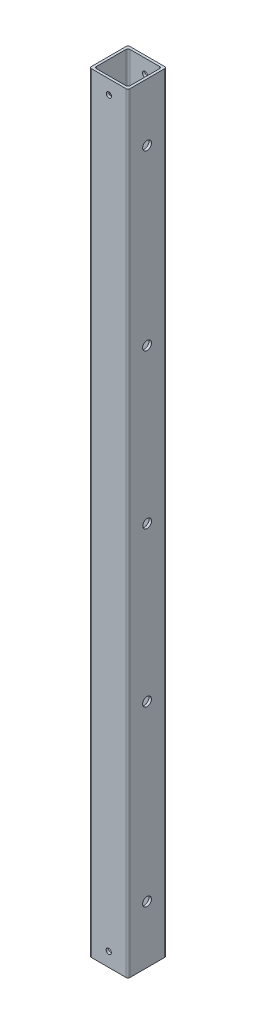
ISO-10303-21;
HEADER;
FILE_DESCRIPTION(('STEP AP214'),'2;1');
FILE_NAME('part.step','',(''),(''),'','','');
FILE_SCHEMA(('AUTOMOTIVE_DESIGN { 1 0 10303 214 1 1 1 1 }'));
ENDSEC;
DATA;
#1=APPLICATION_CONTEXT('core data for automotive mechanical design processes');
#2=APPLICATION_PROTOCOL_DEFINITION('international standard','automotive_design',2000,#1);
#3=PRODUCT_CONTEXT('',#1,'mechanical');
#4=PRODUCT('Part','Part','',(#3));
#5=PRODUCT_RELATED_PRODUCT_CATEGORY('part','',(#4));
#6=PRODUCT_DEFINITION_FORMATION('','',#4);
#7=PRODUCT_DEFINITION_CONTEXT('part definition',#1,'design');
#8=PRODUCT_DEFINITION('design','',#6,#7);
#9=PRODUCT_DEFINITION_SHAPE('','',#8);
#10=(LENGTH_UNIT() NAMED_UNIT(*) SI_UNIT(.MILLI.,.METRE.));
#11=(NAMED_UNIT(*) PLANE_ANGLE_UNIT() SI_UNIT($,.RADIAN.));
#12=(NAMED_UNIT(*) SI_UNIT($,.STERADIAN.) SOLID_ANGLE_UNIT());
#13=UNCERTAINTY_MEASURE_WITH_UNIT(LENGTH_MEASURE(1.E-05),#10,'distance_accuracy_value','');
#14=(GEOMETRIC_REPRESENTATION_CONTEXT(3) GLOBAL_UNCERTAINTY_ASSIGNED_CONTEXT((#13)) GLOBAL_UNIT_ASSIGNED_CONTEXT((#10,
#11,#12)) REPRESENTATION_CONTEXT('',''));
#15=CARTESIAN_POINT('',(0.,0.,0.));
#16=DIRECTION('',(0.,0.,1.));
#17=DIRECTION('',(1.,0.,0.));
#18=AXIS2_PLACEMENT_3D('',#15,#16,#17);
#19=CARTESIAN_POINT('',(0.,508.,0.));
#20=DIRECTION('',(0.,-1.,0.));
#21=DIRECTION('',(0.,0.,-1.));
#22=AXIS2_PLACEMENT_3D('',#19,#20,#21);
#23=PLANE('',#22);
#24=DIRECTION('',(0.,0.,1.));
#25=VECTOR('',#24,1.);
#26=CARTESIAN_POINT('',(-12.7,508.,12.7));
#27=LINE('',#26,#25);
#28=CARTESIAN_POINT('',(-12.7,508.,-11.43));
#29=VERTEX_POINT('',#28);
#30=CARTESIAN_POINT('',(-12.7,508.,11.43));
#31=VERTEX_POINT('',#30);
#32=EDGE_CURVE('E181',#29,#31,#27,.T.);
#33=ORIENTED_EDGE('',*,*,#32,.T.);
#34=CARTESIAN_POINT('',(-11.43,508.,11.43));
#35=DIRECTION('',(0.,-1.,0.));
#36=DIRECTION('',(0.,0.,-1.));
#37=AXIS2_PLACEMENT_3D('',#34,#35,#36);
#38=CIRCLE('',#37,1.27);
#39=CARTESIAN_POINT('',(-11.43,508.,12.7));
#40=VERTEX_POINT('',#39);
#41=EDGE_CURVE('E223',#31,#40,#38,.F.);
#42=ORIENTED_EDGE('',*,*,#41,.T.);
#43=DIRECTION('',(1.,0.,0.));
#44=VECTOR('',#43,1.);
#45=CARTESIAN_POINT('',(-12.7,508.,12.7));
#46=LINE('',#45,#44);
#47=CARTESIAN_POINT('',(11.43,508.,12.7));
#48=VERTEX_POINT('',#47);
#49=EDGE_CURVE('E176',#40,#48,#46,.T.);
#50=ORIENTED_EDGE('',*,*,#49,.T.);
#51=CARTESIAN_POINT('',(11.43,508.,11.43));
#52=DIRECTION('',(0.,-1.,0.));
#53=DIRECTION('',(0.,0.,-1.));
#54=AXIS2_PLACEMENT_3D('',#51,#52,#53);
#55=CIRCLE('',#54,1.27);
#56=CARTESIAN_POINT('',(12.7,508.,11.43));
#57=VERTEX_POINT('',#56);
#58=EDGE_CURVE('E218',#48,#57,#55,.F.);
#59=ORIENTED_EDGE('',*,*,#58,.T.);
#60=DIRECTION('',(0.,0.,-1.));
#61=VECTOR('',#60,1.);
#62=CARTESIAN_POINT('',(12.7,508.,12.7));
#63=LINE('',#62,#61);
#64=CARTESIAN_POINT('',(12.7,508.,-11.43));
#65=VERTEX_POINT('',#64);
#66=EDGE_CURVE('E338',#57,#65,#63,.T.);
#67=ORIENTED_EDGE('',*,*,#66,.T.);
#68=CARTESIAN_POINT('',(11.43,508.,-11.43));
#69=DIRECTION('',(0.,-1.,0.));
#70=DIRECTION('',(0.,0.,-1.));
#71=AXIS2_PLACEMENT_3D('',#68,#69,#70);
#72=CIRCLE('',#71,1.27);
#73=CARTESIAN_POINT('',(11.43,508.,-12.7));
#74=VERTEX_POINT('',#73);
#75=EDGE_CURVE('E59',#65,#74,#72,.F.);
#76=ORIENTED_EDGE('',*,*,#75,.T.);
#77=DIRECTION('',(-1.,0.,0.));
#78=VECTOR('',#77,1.);
#79=CARTESIAN_POINT('',(-12.7,508.,-12.7));
#80=LINE('',#79,#78);
#81=CARTESIAN_POINT('',(-11.43,508.,-12.7));
#82=VERTEX_POINT('',#81);
#83=EDGE_CURVE('E340',#74,#82,#80,.T.);
#84=ORIENTED_EDGE('',*,*,#83,.T.);
#85=CARTESIAN_POINT('',(-11.43,508.,-11.43));
#86=DIRECTION('',(0.,-1.,0.));
#87=DIRECTION('',(0.,0.,-1.));
#88=AXIS2_PLACEMENT_3D('',#85,#86,#87);
#89=CIRCLE('',#88,1.27);
#90=EDGE_CURVE('E221',#82,#29,#89,.F.);
#91=ORIENTED_EDGE('',*,*,#90,.T.);
#92=EDGE_LOOP('',(#33,#42,#50,#59,#67,#76,#84,#91));
#93=FACE_BOUND('',#92,.T.);
#94=DIRECTION('',(1.,0.,0.));
#95=VECTOR('',#94,1.);
#96=CARTESIAN_POINT('',(-11.049,508.,11.049));
#97=LINE('',#96,#95);
#98=CARTESIAN_POINT('',(-9.779,508.,11.049));
#99=VERTEX_POINT('',#98);
#100=CARTESIAN_POINT('',(9.779,508.,11.049));
#101=VERTEX_POINT('',#100);
#102=EDGE_CURVE('E321',#99,#101,#97,.T.);
#103=ORIENTED_EDGE('',*,*,#102,.F.);
#104=CARTESIAN_POINT('',(-9.779,508.,9.779));
#105=DIRECTION('',(0.,-1.,0.));
#106=DIRECTION('',(0.,0.,-1.));
#107=AXIS2_PLACEMENT_3D('',#104,#105,#106);
#108=CIRCLE('',#107,1.27);
#109=CARTESIAN_POINT('',(-11.049,508.,9.779));
#110=VERTEX_POINT('',#109);
#111=EDGE_CURVE('E11',#99,#110,#108,.T.);
#112=ORIENTED_EDGE('',*,*,#111,.T.);
#113=DIRECTION('',(0.,0.,1.));
#114=VECTOR('',#113,1.);
#115=CARTESIAN_POINT('',(-11.049,508.,11.049));
#116=LINE('',#115,#114);
#117=CARTESIAN_POINT('',(-11.049,508.,-9.779));
#118=VERTEX_POINT('',#117);
#119=EDGE_CURVE('E329',#118,#110,#116,.T.);
#120=ORIENTED_EDGE('',*,*,#119,.F.);
#121=CARTESIAN_POINT('',(-9.779,508.,-9.779));
#122=DIRECTION('',(0.,-1.,0.));
#123=DIRECTION('',(0.,0.,-1.));
#124=AXIS2_PLACEMENT_3D('',#121,#122,#123);
#125=CIRCLE('',#124,1.27);
#126=CARTESIAN_POINT('',(-9.779,508.,-11.049));
#127=VERTEX_POINT('',#126);
#128=EDGE_CURVE('E236',#118,#127,#125,.T.);
#129=ORIENTED_EDGE('',*,*,#128,.T.);
#130=DIRECTION('',(-1.,0.,0.));
#131=VECTOR('',#130,1.);
#132=CARTESIAN_POINT('',(-11.049,508.,-11.049));
#133=LINE('',#132,#131);
#134=CARTESIAN_POINT('',(9.779,508.,-11.049));
#135=VERTEX_POINT('',#134);
#136=EDGE_CURVE('E327',#135,#127,#133,.T.);
#137=ORIENTED_EDGE('',*,*,#136,.F.);
#138=CARTESIAN_POINT('',(9.779,508.,-9.779));
#139=DIRECTION('',(0.,-1.,0.));
#140=DIRECTION('',(0.,0.,-1.));
#141=AXIS2_PLACEMENT_3D('',#138,#139,#140);
#142=CIRCLE('',#141,1.27);
#143=CARTESIAN_POINT('',(11.049,508.,-9.779));
#144=VERTEX_POINT('',#143);
#145=EDGE_CURVE('E161',#135,#144,#142,.T.);
#146=ORIENTED_EDGE('',*,*,#145,.T.);
#147=DIRECTION('',(0.,0.,-1.));
#148=VECTOR('',#147,1.);
#149=CARTESIAN_POINT('',(11.049,508.,11.049));
#150=LINE('',#149,#148);
#151=CARTESIAN_POINT('',(11.049,508.,9.779));
#152=VERTEX_POINT('',#151);
#153=EDGE_CURVE('E324',#152,#144,#150,.T.);
#154=ORIENTED_EDGE('',*,*,#153,.F.);
#155=CARTESIAN_POINT('',(9.779,508.,9.779));
#156=DIRECTION('',(0.,-1.,0.));
#157=DIRECTION('',(0.,0.,-1.));
#158=AXIS2_PLACEMENT_3D('',#155,#156,#157);
#159=CIRCLE('',#158,1.27);
#160=EDGE_CURVE('E162',#152,#101,#159,.T.);
#161=ORIENTED_EDGE('',*,*,#160,.T.);
#162=EDGE_LOOP('',(#103,#112,#120,#129,#137,#146,#154,#161));
#163=FACE_BOUND('',#162,.T.);
#164=ADVANCED_FACE('F35',(#93,#163),#23,.F.);
#165=CARTESIAN_POINT('',(0.,0.,0.));
#166=DIRECTION('',(0.,-1.,0.));
#167=DIRECTION('',(0.,0.,-1.));
#168=AXIS2_PLACEMENT_3D('',#165,#166,#167);
#169=PLANE('',#168);
#170=DIRECTION('',(1.,0.,0.));
#171=VECTOR('',#170,1.);
#172=CARTESIAN_POINT('',(-12.7,0.,12.7));
#173=LINE('',#172,#171);
#174=CARTESIAN_POINT('',(-11.43,0.,12.7));
#175=VERTEX_POINT('',#174);
#176=CARTESIAN_POINT('',(11.43,0.,12.7));
#177=VERTEX_POINT('',#176);
#178=EDGE_CURVE('E184',#175,#177,#173,.T.);
#179=ORIENTED_EDGE('',*,*,#178,.F.);
#180=CARTESIAN_POINT('',(-11.43,0.,11.43));
#181=DIRECTION('',(0.,-1.,0.));
#182=DIRECTION('',(0.,0.,-1.));
#183=AXIS2_PLACEMENT_3D('',#180,#181,#182);
#184=CIRCLE('',#183,1.27);
#185=CARTESIAN_POINT('',(-12.7,0.,11.43));
#186=VERTEX_POINT('',#185);
#187=EDGE_CURVE('E211',#175,#186,#184,.T.);
#188=ORIENTED_EDGE('',*,*,#187,.T.);
#189=DIRECTION('',(0.,0.,1.));
#190=VECTOR('',#189,1.);
#191=CARTESIAN_POINT('',(-12.7,0.,12.7));
#192=LINE('',#191,#190);
#193=CARTESIAN_POINT('',(-12.7,0.,-11.43));
#194=VERTEX_POINT('',#193);
#195=EDGE_CURVE('E347',#194,#186,#192,.T.);
#196=ORIENTED_EDGE('',*,*,#195,.F.);
#197=CARTESIAN_POINT('',(-11.43,0.,-11.43));
#198=DIRECTION('',(0.,-1.,0.));
#199=DIRECTION('',(0.,0.,-1.));
#200=AXIS2_PLACEMENT_3D('',#197,#198,#199);
#201=CIRCLE('',#200,1.27);
#202=CARTESIAN_POINT('',(-11.43,0.,-12.7));
#203=VERTEX_POINT('',#202);
#204=EDGE_CURVE('E209',#194,#203,#201,.T.);
#205=ORIENTED_EDGE('',*,*,#204,.T.);
#206=DIRECTION('',(-1.,0.,0.));
#207=VECTOR('',#206,1.);
#208=CARTESIAN_POINT('',(-12.7,0.,-12.7));
#209=LINE('',#208,#207);
#210=CARTESIAN_POINT('',(11.43,0.,-12.7));
#211=VERTEX_POINT('',#210);
#212=EDGE_CURVE('E346',#211,#203,#209,.T.);
#213=ORIENTED_EDGE('',*,*,#212,.F.);
#214=CARTESIAN_POINT('',(11.43,0.,-11.43));
#215=DIRECTION('',(0.,-1.,0.));
#216=DIRECTION('',(0.,0.,-1.));
#217=AXIS2_PLACEMENT_3D('',#214,#215,#216);
#218=CIRCLE('',#217,1.27);
#219=CARTESIAN_POINT('',(12.7,0.,-11.43));
#220=VERTEX_POINT('',#219);
#221=EDGE_CURVE('E207',#211,#220,#218,.T.);
#222=ORIENTED_EDGE('',*,*,#221,.T.);
#223=DIRECTION('',(0.,0.,-1.));
#224=VECTOR('',#223,1.);
#225=CARTESIAN_POINT('',(12.7,0.,12.7));
#226=LINE('',#225,#224);
#227=CARTESIAN_POINT('',(12.7,0.,11.43));
#228=VERTEX_POINT('',#227);
#229=EDGE_CURVE('E332',#228,#220,#226,.T.);
#230=ORIENTED_EDGE('',*,*,#229,.F.);
#231=CARTESIAN_POINT('',(11.43,0.,11.43));
#232=DIRECTION('',(0.,-1.,0.));
#233=DIRECTION('',(0.,0.,-1.));
#234=AXIS2_PLACEMENT_3D('',#231,#232,#233);
#235=CIRCLE('',#234,1.27);
#236=EDGE_CURVE('E205',#228,#177,#235,.T.);
#237=ORIENTED_EDGE('',*,*,#236,.T.);
#238=EDGE_LOOP('',(#179,#188,#196,#205,#213,#222,#230,#237));
#239=FACE_BOUND('',#238,.T.);
#240=DIRECTION('',(-1.,0.,0.));
#241=VECTOR('',#240,1.);
#242=CARTESIAN_POINT('',(-11.049,0.,-11.049));
#243=LINE('',#242,#241);
#244=CARTESIAN_POINT('',(9.779,0.,-11.049));
#245=VERTEX_POINT('',#244);
#246=CARTESIAN_POINT('',(-9.779,0.,-11.049));
#247=VERTEX_POINT('',#246);
#248=EDGE_CURVE('E154',#245,#247,#243,.T.);
#249=ORIENTED_EDGE('',*,*,#248,.T.);
#250=CARTESIAN_POINT('',(-9.779,0.,-9.779));
#251=DIRECTION('',(0.,-1.,0.));
#252=DIRECTION('',(0.,0.,-1.));
#253=AXIS2_PLACEMENT_3D('',#250,#251,#252);
#254=CIRCLE('',#253,1.27);
#255=CARTESIAN_POINT('',(-11.049,0.,-9.779));
#256=VERTEX_POINT('',#255);
#257=EDGE_CURVE('E234',#247,#256,#254,.F.);
#258=ORIENTED_EDGE('',*,*,#257,.T.);
#259=DIRECTION('',(0.,0.,1.));
#260=VECTOR('',#259,1.);
#261=CARTESIAN_POINT('',(-11.049,0.,11.049));
#262=LINE('',#261,#260);
#263=CARTESIAN_POINT('',(-11.049,0.,9.779));
#264=VERTEX_POINT('',#263);
#265=EDGE_CURVE('E172',#256,#264,#262,.T.);
#266=ORIENTED_EDGE('',*,*,#265,.T.);
#267=CARTESIAN_POINT('',(-9.779,0.,9.779));
#268=DIRECTION('',(0.,-1.,0.));
#269=DIRECTION('',(0.,0.,-1.));
#270=AXIS2_PLACEMENT_3D('',#267,#268,#269);
#271=CIRCLE('',#270,1.27);
#272=CARTESIAN_POINT('',(-9.779,0.,11.049));
#273=VERTEX_POINT('',#272);
#274=EDGE_CURVE('E44',#264,#273,#271,.F.);
#275=ORIENTED_EDGE('',*,*,#274,.T.);
#276=DIRECTION('',(1.,0.,0.));
#277=VECTOR('',#276,1.);
#278=CARTESIAN_POINT('',(-11.049,0.,11.049));
#279=LINE('',#278,#277);
#280=CARTESIAN_POINT('',(9.779,0.,11.049));
#281=VERTEX_POINT('',#280);
#282=EDGE_CURVE('E320',#273,#281,#279,.T.);
#283=ORIENTED_EDGE('',*,*,#282,.T.);
#284=CARTESIAN_POINT('',(9.779,0.,9.779));
#285=DIRECTION('',(0.,-1.,0.));
#286=DIRECTION('',(0.,0.,-1.));
#287=AXIS2_PLACEMENT_3D('',#284,#285,#286);
#288=CIRCLE('',#287,1.27);
#289=CARTESIAN_POINT('',(11.049,0.,9.779));
#290=VERTEX_POINT('',#289);
#291=EDGE_CURVE('E238',#281,#290,#288,.F.);
#292=ORIENTED_EDGE('',*,*,#291,.T.);
#293=DIRECTION('',(0.,0.,-1.));
#294=VECTOR('',#293,1.);
#295=CARTESIAN_POINT('',(11.049,0.,11.049));
#296=LINE('',#295,#294);
#297=CARTESIAN_POINT('',(11.049,0.,-9.779));
#298=VERTEX_POINT('',#297);
#299=EDGE_CURVE('E156',#290,#298,#296,.T.);
#300=ORIENTED_EDGE('',*,*,#299,.T.);
#301=CARTESIAN_POINT('',(9.779,0.,-9.779));
#302=DIRECTION('',(0.,-1.,0.));
#303=DIRECTION('',(0.,0.,-1.));
#304=AXIS2_PLACEMENT_3D('',#301,#302,#303);
#305=CIRCLE('',#304,1.27);
#306=EDGE_CURVE('E151',#298,#245,#305,.F.);
#307=ORIENTED_EDGE('',*,*,#306,.T.);
#308=EDGE_LOOP('',(#249,#258,#266,#275,#283,#292,#300,#307));
#309=FACE_BOUND('',#308,.T.);
#310=ADVANCED_FACE('F153',(#239,#309),#169,.T.);
#311=CARTESIAN_POINT('',(12.7,508.,12.7));
#312=DIRECTION('',(-1.,0.,0.));
#313=DIRECTION('',(0.,0.,1.));
#314=AXIS2_PLACEMENT_3D('',#311,#312,#313);
#315=PLANE('',#314);
#316=CARTESIAN_POINT('',(12.7,469.9,0.152399999999886));
#317=DIRECTION('',(-1.,0.,0.));
#318=DIRECTION('',(0.,0.,1.));
#319=AXIS2_PLACEMENT_3D('',#316,#317,#318);
#320=CIRCLE('',#319,2.8956);
#321=CARTESIAN_POINT('',(12.7,469.9,3.04799999999988));
#322=VERTEX_POINT('',#321);
#323=EDGE_CURVE('E261',#322,#322,#320,.T.);
#324=ORIENTED_EDGE('',*,*,#323,.T.);
#325=EDGE_LOOP('',(#324));
#326=FACE_BOUND('',#325,.T.);
#327=CARTESIAN_POINT('',(12.7,355.6,0.152399999999941));
#328=DIRECTION('',(-1.,0.,0.));
#329=DIRECTION('',(0.,0.,1.));
#330=AXIS2_PLACEMENT_3D('',#327,#328,#329);
#331=CIRCLE('',#330,2.8956);
#332=CARTESIAN_POINT('',(12.7,355.6,3.04799999999994));
#333=VERTEX_POINT('',#332);
#334=EDGE_CURVE('E290',#333,#333,#331,.T.);
#335=ORIENTED_EDGE('',*,*,#334,.T.);
#336=EDGE_LOOP('',(#335));
#337=FACE_BOUND('',#336,.T.);
#338=CARTESIAN_POINT('',(12.7,253.8476,0.0761999999998042));
#339=DIRECTION('',(-1.,0.,0.));
#340=DIRECTION('',(0.,0.,1.));
#341=AXIS2_PLACEMENT_3D('',#338,#339,#340);
#342=CIRCLE('',#341,2.8956);
#343=CARTESIAN_POINT('',(12.7,253.8476,2.9717999999998));
#344=VERTEX_POINT('',#343);
#345=EDGE_CURVE('E257',#344,#344,#342,.T.);
#346=ORIENTED_EDGE('',*,*,#345,.T.);
#347=EDGE_LOOP('',(#346));
#348=FACE_BOUND('',#347,.T.);
#349=CARTESIAN_POINT('',(12.7,152.0952,0.152400000000108));
#350=DIRECTION('',(-1.,0.,0.));
#351=DIRECTION('',(0.,0.,1.));
#352=AXIS2_PLACEMENT_3D('',#349,#350,#351);
#353=CIRCLE('',#352,2.8956);
#354=CARTESIAN_POINT('',(12.7,152.0952,3.04800000000011));
#355=VERTEX_POINT('',#354);
#356=EDGE_CURVE('E252',#355,#355,#353,.T.);
#357=ORIENTED_EDGE('',*,*,#356,.T.);
#358=EDGE_LOOP('',(#357));
#359=FACE_BOUND('',#358,.T.);
#360=CARTESIAN_POINT('',(12.7,37.7951999999999,0.152399999999886));
#361=DIRECTION('',(-1.,0.,0.));
#362=DIRECTION('',(0.,0.,1.));
#363=AXIS2_PLACEMENT_3D('',#360,#361,#362);
#364=CIRCLE('',#363,2.8956);
#365=CARTESIAN_POINT('',(12.7,37.7951999999999,3.04799999999988));
#366=VERTEX_POINT('',#365);
#367=EDGE_CURVE('E247',#366,#366,#364,.T.);
#368=ORIENTED_EDGE('',*,*,#367,.T.);
#369=EDGE_LOOP('',(#368));
#370=FACE_BOUND('',#369,.T.);
#371=ORIENTED_EDGE('',*,*,#229,.T.);
#372=DIRECTION('',(0.,-1.,0.));
#373=VECTOR('',#372,1.);
#374=CARTESIAN_POINT('',(12.7,508.,-11.43));
#375=LINE('',#374,#373);
#376=EDGE_CURVE('E232',#220,#65,#375,.F.);
#377=ORIENTED_EDGE('',*,*,#376,.T.);
#378=ORIENTED_EDGE('',*,*,#66,.F.);
#379=DIRECTION('',(0.,-1.,0.));
#380=VECTOR('',#379,1.);
#381=CARTESIAN_POINT('',(12.7,508.,11.43));
#382=LINE('',#381,#380);
#383=EDGE_CURVE('E229',#57,#228,#382,.T.);
#384=ORIENTED_EDGE('',*,*,#383,.T.);
#385=EDGE_LOOP('',(#371,#377,#378,#384));
#386=FACE_BOUND('',#385,.T.);
#387=ADVANCED_FACE('F366',(#326,#337,#348,#359,#370,#386),#315,.F.);
#388=CARTESIAN_POINT('',(-12.7,508.,-12.7));
#389=DIRECTION('',(0.,0.,1.));
#390=DIRECTION('',(1.,0.,0.));
#391=AXIS2_PLACEMENT_3D('',#388,#389,#390);
#392=PLANE('',#391);
#393=CARTESIAN_POINT('',(0.,9.271,-12.7));
#394=DIRECTION('',(0.,0.,1.));
#395=DIRECTION('',(1.,0.,0.));
#396=AXIS2_PLACEMENT_3D('',#393,#394,#395);
#397=CIRCLE('',#396,1.72719999999999);
#398=CARTESIAN_POINT('',(1.72720000000006,9.271,-12.7));
#399=VERTEX_POINT('',#398);
#400=EDGE_CURVE('E786',#399,#399,#397,.T.);
#401=ORIENTED_EDGE('',*,*,#400,.T.);
#402=EDGE_LOOP('',(#401));
#403=FACE_BOUND('',#402,.T.);
#404=CARTESIAN_POINT('',(0.103095801553498,498.728999999999,-12.7));
#405=DIRECTION('',(0.,0.,1.));
#406=DIRECTION('',(1.,0.,0.));
#407=AXIS2_PLACEMENT_3D('',#404,#405,#406);
#408=CIRCLE('',#407,1.72719999999999);
#409=CARTESIAN_POINT('',(1.83029580155349,498.728999999999,-12.7));
#410=VERTEX_POINT('',#409);
#411=EDGE_CURVE('E265',#410,#410,#408,.T.);
#412=ORIENTED_EDGE('',*,*,#411,.T.);
#413=EDGE_LOOP('',(#412));
#414=FACE_BOUND('',#413,.T.);
#415=ORIENTED_EDGE('',*,*,#212,.T.);
#416=DIRECTION('',(0.,-1.,0.));
#417=VECTOR('',#416,1.);
#418=CARTESIAN_POINT('',(-11.43,508.,-12.7));
#419=LINE('',#418,#417);
#420=EDGE_CURVE('E52',#203,#82,#419,.F.);
#421=ORIENTED_EDGE('',*,*,#420,.T.);
#422=ORIENTED_EDGE('',*,*,#83,.F.);
#423=DIRECTION('',(0.,-1.,0.));
#424=VECTOR('',#423,1.);
#425=CARTESIAN_POINT('',(11.43,508.,-12.7));
#426=LINE('',#425,#424);
#427=EDGE_CURVE('E225',#74,#211,#426,.T.);
#428=ORIENTED_EDGE('',*,*,#427,.T.);
#429=EDGE_LOOP('',(#415,#421,#422,#428));
#430=FACE_BOUND('',#429,.T.);
#431=ADVANCED_FACE('F373',(#403,#414,#430),#392,.F.);
#432=CARTESIAN_POINT('',(-12.7,508.,12.7));
#433=DIRECTION('',(1.,0.,0.));
#434=DIRECTION('',(0.,0.,-1.));
#435=AXIS2_PLACEMENT_3D('',#432,#433,#434);
#436=PLANE('',#435);
#437=CARTESIAN_POINT('',(-12.7,469.9,0.152399999999886));
#438=DIRECTION('',(-1.,0.,0.));
#439=DIRECTION('',(0.,0.,1.));
#440=AXIS2_PLACEMENT_3D('',#437,#438,#439);
#441=CIRCLE('',#440,2.8956);
#442=CARTESIAN_POINT('',(-12.7,469.9,3.04799999999988));
#443=VERTEX_POINT('',#442);
#444=EDGE_CURVE('E269',#443,#443,#441,.T.);
#445=ORIENTED_EDGE('',*,*,#444,.F.);
#446=EDGE_LOOP('',(#445));
#447=FACE_BOUND('',#446,.T.);
#448=CARTESIAN_POINT('',(-12.7,355.6,0.152399999999941));
#449=DIRECTION('',(-1.,0.,0.));
#450=DIRECTION('',(0.,0.,1.));
#451=AXIS2_PLACEMENT_3D('',#448,#449,#450);
#452=CIRCLE('',#451,2.8956);
#453=CARTESIAN_POINT('',(-12.7,355.6,3.04799999999994));
#454=VERTEX_POINT('',#453);
#455=EDGE_CURVE('E287',#454,#454,#452,.T.);
#456=ORIENTED_EDGE('',*,*,#455,.F.);
#457=EDGE_LOOP('',(#456));
#458=FACE_BOUND('',#457,.T.);
#459=CARTESIAN_POINT('',(-12.7,253.8476,0.0761999999998042));
#460=DIRECTION('',(-1.,0.,0.));
#461=DIRECTION('',(0.,0.,1.));
#462=AXIS2_PLACEMENT_3D('',#459,#460,#461);
#463=CIRCLE('',#462,2.8956);
#464=CARTESIAN_POINT('',(-12.7,253.8476,2.9717999999998));
#465=VERTEX_POINT('',#464);
#466=EDGE_CURVE('E299',#465,#465,#463,.T.);
#467=ORIENTED_EDGE('',*,*,#466,.F.);
#468=EDGE_LOOP('',(#467));
#469=FACE_BOUND('',#468,.T.);
#470=CARTESIAN_POINT('',(-12.7,152.0952,0.152400000000108));
#471=DIRECTION('',(-1.,0.,0.));
#472=DIRECTION('',(0.,0.,1.));
#473=AXIS2_PLACEMENT_3D('',#470,#471,#472);
#474=CIRCLE('',#473,2.8956);
#475=CARTESIAN_POINT('',(-12.7,152.0952,3.04800000000011));
#476=VERTEX_POINT('',#475);
#477=EDGE_CURVE('E306',#476,#476,#474,.T.);
#478=ORIENTED_EDGE('',*,*,#477,.F.);
#479=EDGE_LOOP('',(#478));
#480=FACE_BOUND('',#479,.T.);
#481=CARTESIAN_POINT('',(-12.7,37.7951999999999,0.152399999999886));
#482=DIRECTION('',(-1.,0.,0.));
#483=DIRECTION('',(0.,0.,1.));
#484=AXIS2_PLACEMENT_3D('',#481,#482,#483);
#485=CIRCLE('',#484,2.89559999999998);
#486=CARTESIAN_POINT('',(-12.7,37.7951999999999,3.04799999999987));
#487=VERTEX_POINT('',#486);
#488=EDGE_CURVE('E313',#487,#487,#485,.T.);
#489=ORIENTED_EDGE('',*,*,#488,.F.);
#490=EDGE_LOOP('',(#489));
#491=FACE_BOUND('',#490,.T.);
#492=ORIENTED_EDGE('',*,*,#195,.T.);
#493=DIRECTION('',(0.,-1.,0.));
#494=VECTOR('',#493,1.);
#495=CARTESIAN_POINT('',(-12.7,508.,11.43));
#496=LINE('',#495,#494);
#497=EDGE_CURVE('E216',#186,#31,#496,.F.);
#498=ORIENTED_EDGE('',*,*,#497,.T.);
#499=ORIENTED_EDGE('',*,*,#32,.F.);
#500=DIRECTION('',(0.,-1.,0.));
#501=VECTOR('',#500,1.);
#502=CARTESIAN_POINT('',(-12.7,508.,-11.43));
#503=LINE('',#502,#501);
#504=EDGE_CURVE('E213',#29,#194,#503,.T.);
#505=ORIENTED_EDGE('',*,*,#504,.T.);
#506=EDGE_LOOP('',(#492,#498,#499,#505));
#507=FACE_BOUND('',#506,.T.);
#508=ADVANCED_FACE('F379',(#447,#458,#469,#480,#491,#507),#436,.F.);
#509=CARTESIAN_POINT('',(-12.7,508.,12.7));
#510=DIRECTION('',(0.,0.,-1.));
#511=DIRECTION('',(-1.,0.,0.));
#512=AXIS2_PLACEMENT_3D('',#509,#510,#511);
#513=PLANE('',#512);
#514=CARTESIAN_POINT('',(0.,9.271,12.7));
#515=DIRECTION('',(0.,0.,1.));
#516=DIRECTION('',(1.,0.,0.));
#517=AXIS2_PLACEMENT_3D('',#514,#515,#516);
#518=CIRCLE('',#517,1.7272);
#519=CARTESIAN_POINT('',(1.72720000000006,9.271,12.7));
#520=VERTEX_POINT('',#519);
#521=EDGE_CURVE('E790',#520,#520,#518,.T.);
#522=ORIENTED_EDGE('',*,*,#521,.F.);
#523=EDGE_LOOP('',(#522));
#524=FACE_BOUND('',#523,.T.);
#525=CARTESIAN_POINT('',(0.103095801553498,498.728999999999,12.7));
#526=DIRECTION('',(0.,0.,1.));
#527=DIRECTION('',(1.,0.,0.));
#528=AXIS2_PLACEMENT_3D('',#525,#526,#527);
#529=CIRCLE('',#528,1.7272);
#530=CARTESIAN_POINT('',(1.8302958015535,498.728999999999,12.7));
#531=VERTEX_POINT('',#530);
#532=EDGE_CURVE('E272',#531,#531,#529,.T.);
#533=ORIENTED_EDGE('',*,*,#532,.F.);
#534=EDGE_LOOP('',(#533));
#535=FACE_BOUND('',#534,.T.);
#536=ORIENTED_EDGE('',*,*,#49,.F.);
#537=DIRECTION('',(0.,-1.,0.));
#538=VECTOR('',#537,1.);
#539=CARTESIAN_POINT('',(-11.43,508.,12.7));
#540=LINE('',#539,#538);
#541=EDGE_CURVE('E202',#40,#175,#540,.T.);
#542=ORIENTED_EDGE('',*,*,#541,.T.);
#543=ORIENTED_EDGE('',*,*,#178,.T.);
#544=DIRECTION('',(0.,-1.,0.));
#545=VECTOR('',#544,1.);
#546=CARTESIAN_POINT('',(11.43,508.,12.7));
#547=LINE('',#546,#545);
#548=EDGE_CURVE('E200',#177,#48,#547,.F.);
#549=ORIENTED_EDGE('',*,*,#548,.T.);
#550=EDGE_LOOP('',(#536,#542,#543,#549));
#551=FACE_BOUND('',#550,.T.);
#552=ADVANCED_FACE('F357',(#524,#535,#551),#513,.F.);
#553=CARTESIAN_POINT('',(-11.049,508.,11.049));
#554=DIRECTION('',(0.,0.,-1.));
#555=DIRECTION('',(-1.,0.,0.));
#556=AXIS2_PLACEMENT_3D('',#553,#554,#555);
#557=PLANE('',#556);
#558=CARTESIAN_POINT('',(0.,9.271,11.049));
#559=DIRECTION('',(0.,0.,-1.));
#560=DIRECTION('',(-1.,0.,0.));
#561=AXIS2_PLACEMENT_3D('',#558,#559,#560);
#562=CIRCLE('',#561,1.7272);
#563=CARTESIAN_POINT('',(-1.72719999999993,9.271,11.049));
#564=VERTEX_POINT('',#563);
#565=EDGE_CURVE('E277',#564,#564,#562,.T.);
#566=ORIENTED_EDGE('',*,*,#565,.F.);
#567=EDGE_LOOP('',(#566));
#568=FACE_BOUND('',#567,.T.);
#569=CARTESIAN_POINT('',(0.103095801553498,498.728999999999,11.049));
#570=DIRECTION('',(0.,0.,-1.));
#571=DIRECTION('',(-1.,0.,0.));
#572=AXIS2_PLACEMENT_3D('',#569,#570,#571);
#573=CIRCLE('',#572,1.7272);
#574=CARTESIAN_POINT('',(-1.6241041984465,498.728999999999,11.049));
#575=VERTEX_POINT('',#574);
#576=EDGE_CURVE('E264',#575,#575,#573,.T.);
#577=ORIENTED_EDGE('',*,*,#576,.F.);
#578=EDGE_LOOP('',(#577));
#579=FACE_BOUND('',#578,.T.);
#580=ORIENTED_EDGE('',*,*,#102,.T.);
#581=DIRECTION('',(0.,-1.,0.));
#582=VECTOR('',#581,1.);
#583=CARTESIAN_POINT('',(9.779,0.,11.049));
#584=LINE('',#583,#582);
#585=EDGE_CURVE('E193',#101,#281,#584,.T.);
#586=ORIENTED_EDGE('',*,*,#585,.T.);
#587=ORIENTED_EDGE('',*,*,#282,.F.);
#588=DIRECTION('',(0.,-1.,0.));
#589=VECTOR('',#588,1.);
#590=CARTESIAN_POINT('',(-9.779,508.,11.049));
#591=LINE('',#590,#589);
#592=EDGE_CURVE('E191',#273,#99,#591,.F.);
#593=ORIENTED_EDGE('',*,*,#592,.T.);
#594=EDGE_LOOP('',(#580,#586,#587,#593));
#595=FACE_BOUND('',#594,.T.);
#596=ADVANCED_FACE('F400',(#568,#579,#595),#557,.T.);
#597=CARTESIAN_POINT('',(11.049,508.,11.049));
#598=DIRECTION('',(-1.,0.,0.));
#599=DIRECTION('',(0.,0.,1.));
#600=AXIS2_PLACEMENT_3D('',#597,#598,#599);
#601=PLANE('',#600);
#602=CARTESIAN_POINT('',(11.049,469.9,0.152399999999886));
#603=DIRECTION('',(-1.,0.,0.));
#604=DIRECTION('',(0.,0.,1.));
#605=AXIS2_PLACEMENT_3D('',#602,#603,#604);
#606=CIRCLE('',#605,2.8956);
#607=CARTESIAN_POINT('',(11.049,469.9,3.04799999999988));
#608=VERTEX_POINT('',#607);
#609=EDGE_CURVE('E260',#608,#608,#606,.T.);
#610=ORIENTED_EDGE('',*,*,#609,.F.);
#611=EDGE_LOOP('',(#610));
#612=FACE_BOUND('',#611,.T.);
#613=CARTESIAN_POINT('',(11.049,355.6,0.152399999999941));
#614=DIRECTION('',(-1.,0.,0.));
#615=DIRECTION('',(0.,0.,1.));
#616=AXIS2_PLACEMENT_3D('',#613,#614,#615);
#617=CIRCLE('',#616,2.8956);
#618=CARTESIAN_POINT('',(11.049,355.6,3.04799999999994));
#619=VERTEX_POINT('',#618);
#620=EDGE_CURVE('E293',#619,#619,#617,.T.);
#621=ORIENTED_EDGE('',*,*,#620,.F.);
#622=EDGE_LOOP('',(#621));
#623=FACE_BOUND('',#622,.T.);
#624=CARTESIAN_POINT('',(11.049,253.8476,0.0761999999998042));
#625=DIRECTION('',(-1.,0.,0.));
#626=DIRECTION('',(0.,0.,1.));
#627=AXIS2_PLACEMENT_3D('',#624,#625,#626);
#628=CIRCLE('',#627,2.8956);
#629=CARTESIAN_POINT('',(11.049,253.8476,2.9717999999998));
#630=VERTEX_POINT('',#629);
#631=EDGE_CURVE('E256',#630,#630,#628,.T.);
#632=ORIENTED_EDGE('',*,*,#631,.F.);
#633=EDGE_LOOP('',(#632));
#634=FACE_BOUND('',#633,.T.);
#635=CARTESIAN_POINT('',(11.049,152.0952,0.152400000000108));
#636=DIRECTION('',(-1.,0.,0.));
#637=DIRECTION('',(0.,0.,1.));
#638=AXIS2_PLACEMENT_3D('',#635,#636,#637);
#639=CIRCLE('',#638,2.8956);
#640=CARTESIAN_POINT('',(11.049,152.0952,3.04800000000011));
#641=VERTEX_POINT('',#640);
#642=EDGE_CURVE('E251',#641,#641,#639,.T.);
#643=ORIENTED_EDGE('',*,*,#642,.F.);
#644=EDGE_LOOP('',(#643));
#645=FACE_BOUND('',#644,.T.);
#646=CARTESIAN_POINT('',(11.049,37.7951999999999,0.152399999999886));
#647=DIRECTION('',(-1.,0.,0.));
#648=DIRECTION('',(0.,0.,1.));
#649=AXIS2_PLACEMENT_3D('',#646,#647,#648);
#650=CIRCLE('',#649,2.89559999999999);
#651=CARTESIAN_POINT('',(11.049,37.7951999999999,3.04799999999988));
#652=VERTEX_POINT('',#651);
#653=EDGE_CURVE('E246',#652,#652,#650,.T.);
#654=ORIENTED_EDGE('',*,*,#653,.F.);
#655=EDGE_LOOP('',(#654));
#656=FACE_BOUND('',#655,.T.);
#657=ORIENTED_EDGE('',*,*,#299,.F.);
#658=DIRECTION('',(0.,-1.,0.));
#659=VECTOR('',#658,1.);
#660=CARTESIAN_POINT('',(11.049,508.,9.779));
#661=LINE('',#660,#659);
#662=EDGE_CURVE('E198',#290,#152,#661,.F.);
#663=ORIENTED_EDGE('',*,*,#662,.T.);
#664=ORIENTED_EDGE('',*,*,#153,.T.);
#665=DIRECTION('',(0.,-1.,0.));
#666=VECTOR('',#665,1.);
#667=CARTESIAN_POINT('',(11.049,0.,-9.779));
#668=LINE('',#667,#666);
#669=EDGE_CURVE('E196',#144,#298,#668,.T.);
#670=ORIENTED_EDGE('',*,*,#669,.T.);
#671=EDGE_LOOP('',(#657,#663,#664,#670));
#672=FACE_BOUND('',#671,.T.);
#673=ADVANCED_FACE('F513',(#612,#623,#634,#645,#656,#672),#601,.T.);
#674=CARTESIAN_POINT('',(-11.049,508.,-11.049));
#675=DIRECTION('',(0.,0.,1.));
#676=DIRECTION('',(1.,0.,0.));
#677=AXIS2_PLACEMENT_3D('',#674,#675,#676);
#678=PLANE('',#677);
#679=CARTESIAN_POINT('',(0.,9.271,-11.049));
#680=DIRECTION('',(0.,0.,1.));
#681=DIRECTION('',(1.,0.,0.));
#682=AXIS2_PLACEMENT_3D('',#679,#680,#681);
#683=CIRCLE('',#682,1.7272);
#684=CARTESIAN_POINT('',(1.72720000000006,9.271,-11.049));
#685=VERTEX_POINT('',#684);
#686=EDGE_CURVE('E39',#685,#685,#683,.T.);
#687=ORIENTED_EDGE('',*,*,#686,.F.);
#688=EDGE_LOOP('',(#687));
#689=FACE_BOUND('',#688,.T.);
#690=CARTESIAN_POINT('',(0.103095801553498,498.728999999999,-11.049));
#691=DIRECTION('',(0.,0.,1.));
#692=DIRECTION('',(1.,0.,0.));
#693=AXIS2_PLACEMENT_3D('',#690,#691,#692);
#694=CIRCLE('',#693,1.7272);
#695=CARTESIAN_POINT('',(1.83029580155349,498.728999999999,-11.049));
#696=VERTEX_POINT('',#695);
#697=EDGE_CURVE('E262',#696,#696,#694,.T.);
#698=ORIENTED_EDGE('',*,*,#697,.F.);
#699=EDGE_LOOP('',(#698));
#700=FACE_BOUND('',#699,.T.);
#701=ORIENTED_EDGE('',*,*,#136,.T.);
#702=DIRECTION('',(0.,-1.,0.));
#703=VECTOR('',#702,1.);
#704=CARTESIAN_POINT('',(-9.779,0.,-11.049));
#705=LINE('',#704,#703);
#706=EDGE_CURVE('E171',#127,#247,#705,.T.);
#707=ORIENTED_EDGE('',*,*,#706,.T.);
#708=ORIENTED_EDGE('',*,*,#248,.F.);
#709=DIRECTION('',(0.,-1.,0.));
#710=VECTOR('',#709,1.);
#711=CARTESIAN_POINT('',(9.779,508.,-11.049));
#712=LINE('',#711,#710);
#713=EDGE_CURVE('E168',#245,#135,#712,.F.);
#714=ORIENTED_EDGE('',*,*,#713,.T.);
#715=EDGE_LOOP('',(#701,#707,#708,#714));
#716=FACE_BOUND('',#715,.T.);
#717=ADVANCED_FACE('F167',(#689,#700,#716),#678,.T.);
#718=CARTESIAN_POINT('',(-11.049,508.,11.049));
#719=DIRECTION('',(1.,0.,0.));
#720=DIRECTION('',(0.,0.,-1.));
#721=AXIS2_PLACEMENT_3D('',#718,#719,#720);
#722=PLANE('',#721);
#723=CARTESIAN_POINT('',(-11.049,469.9,0.152399999999886));
#724=DIRECTION('',(1.,0.,0.));
#725=DIRECTION('',(0.,0.,-1.));
#726=AXIS2_PLACEMENT_3D('',#723,#724,#725);
#727=CIRCLE('',#726,2.8956);
#728=CARTESIAN_POINT('',(-11.049,469.9,-2.74320000000011));
#729=VERTEX_POINT('',#728);
#730=EDGE_CURVE('E258',#729,#729,#727,.T.);
#731=ORIENTED_EDGE('',*,*,#730,.F.);
#732=EDGE_LOOP('',(#731));
#733=FACE_BOUND('',#732,.T.);
#734=CARTESIAN_POINT('',(-11.049,355.6,0.152399999999941));
#735=DIRECTION('',(1.,0.,0.));
#736=DIRECTION('',(0.,0.,-1.));
#737=AXIS2_PLACEMENT_3D('',#734,#735,#736);
#738=CIRCLE('',#737,2.8956);
#739=CARTESIAN_POINT('',(-11.049,355.6,-2.74320000000006));
#740=VERTEX_POINT('',#739);
#741=EDGE_CURVE('E296',#740,#740,#738,.T.);
#742=ORIENTED_EDGE('',*,*,#741,.F.);
#743=EDGE_LOOP('',(#742));
#744=FACE_BOUND('',#743,.T.);
#745=CARTESIAN_POINT('',(-11.049,253.8476,0.0761999999998042));
#746=DIRECTION('',(1.,0.,0.));
#747=DIRECTION('',(0.,0.,-1.));
#748=AXIS2_PLACEMENT_3D('',#745,#746,#747);
#749=CIRCLE('',#748,2.8956);
#750=CARTESIAN_POINT('',(-11.049,253.8476,-2.81940000000019));
#751=VERTEX_POINT('',#750);
#752=EDGE_CURVE('E253',#751,#751,#749,.T.);
#753=ORIENTED_EDGE('',*,*,#752,.F.);
#754=EDGE_LOOP('',(#753));
#755=FACE_BOUND('',#754,.T.);
#756=CARTESIAN_POINT('',(-11.049,152.0952,0.152400000000108));
#757=DIRECTION('',(1.,0.,0.));
#758=DIRECTION('',(0.,0.,-1.));
#759=AXIS2_PLACEMENT_3D('',#756,#757,#758);
#760=CIRCLE('',#759,2.8956);
#761=CARTESIAN_POINT('',(-11.049,152.0952,-2.74319999999989));
#762=VERTEX_POINT('',#761);
#763=EDGE_CURVE('E248',#762,#762,#760,.T.);
#764=ORIENTED_EDGE('',*,*,#763,.F.);
#765=EDGE_LOOP('',(#764));
#766=FACE_BOUND('',#765,.T.);
#767=CARTESIAN_POINT('',(-11.049,37.7951999999999,0.152399999999886));
#768=DIRECTION('',(1.,0.,0.));
#769=DIRECTION('',(0.,0.,-1.));
#770=AXIS2_PLACEMENT_3D('',#767,#768,#769);
#771=CIRCLE('',#770,2.89559999999999);
#772=CARTESIAN_POINT('',(-11.049,37.7951999999999,-2.74320000000011));
#773=VERTEX_POINT('',#772);
#774=EDGE_CURVE('E243',#773,#773,#771,.T.);
#775=ORIENTED_EDGE('',*,*,#774,.F.);
#776=EDGE_LOOP('',(#775));
#777=FACE_BOUND('',#776,.T.);
#778=ORIENTED_EDGE('',*,*,#265,.F.);
#779=DIRECTION('',(0.,-1.,0.));
#780=VECTOR('',#779,1.);
#781=CARTESIAN_POINT('',(-11.049,508.,-9.779));
#782=LINE('',#781,#780);
#783=EDGE_CURVE('E189',#256,#118,#782,.F.);
#784=ORIENTED_EDGE('',*,*,#783,.T.);
#785=ORIENTED_EDGE('',*,*,#119,.T.);
#786=DIRECTION('',(0.,-1.,0.));
#787=VECTOR('',#786,1.);
#788=CARTESIAN_POINT('',(-11.049,0.,9.779));
#789=LINE('',#788,#787);
#790=EDGE_CURVE('E178',#110,#264,#789,.T.);
#791=ORIENTED_EDGE('',*,*,#790,.T.);
#792=EDGE_LOOP('',(#778,#784,#785,#791));
#793=FACE_BOUND('',#792,.T.);
#794=ADVANCED_FACE('F419',(#733,#744,#755,#766,#777,#793),#722,.T.);
#795=CARTESIAN_POINT('',(-9.779,508.,-9.779));
#796=DIRECTION('',(0.,1.,0.));
#797=DIRECTION('',(0.,0.,1.));
#798=AXIS2_PLACEMENT_3D('',#795,#796,#797);
#799=CYLINDRICAL_SURFACE('',#798,1.27);
#800=ORIENTED_EDGE('',*,*,#128,.F.);
#801=ORIENTED_EDGE('',*,*,#783,.F.);
#802=ORIENTED_EDGE('',*,*,#257,.F.);
#803=ORIENTED_EDGE('',*,*,#706,.F.);
#804=EDGE_LOOP('',(#800,#801,#802,#803));
#805=FACE_BOUND('',#804,.T.);
#806=ADVANCED_FACE('F415',(#805),#799,.F.);
#807=CARTESIAN_POINT('',(9.779,508.,9.779));
#808=DIRECTION('',(0.,1.,0.));
#809=DIRECTION('',(0.,0.,1.));
#810=AXIS2_PLACEMENT_3D('',#807,#808,#809);
#811=CYLINDRICAL_SURFACE('',#810,1.27);
#812=ORIENTED_EDGE('',*,*,#160,.F.);
#813=ORIENTED_EDGE('',*,*,#662,.F.);
#814=ORIENTED_EDGE('',*,*,#291,.F.);
#815=ORIENTED_EDGE('',*,*,#585,.F.);
#816=EDGE_LOOP('',(#812,#813,#814,#815));
#817=FACE_BOUND('',#816,.T.);
#818=ADVANCED_FACE('F418',(#817),#811,.F.);
#819=CARTESIAN_POINT('',(9.779,508.,-9.779));
#820=DIRECTION('',(0.,1.,0.));
#821=DIRECTION('',(0.,0.,1.));
#822=AXIS2_PLACEMENT_3D('',#819,#820,#821);
#823=CYLINDRICAL_SURFACE('',#822,1.27);
#824=ORIENTED_EDGE('',*,*,#145,.F.);
#825=ORIENTED_EDGE('',*,*,#713,.F.);
#826=ORIENTED_EDGE('',*,*,#306,.F.);
#827=ORIENTED_EDGE('',*,*,#669,.F.);
#828=EDGE_LOOP('',(#824,#825,#826,#827));
#829=FACE_BOUND('',#828,.T.);
#830=ADVANCED_FACE('F175',(#829),#823,.F.);
#831=CARTESIAN_POINT('',(-9.779,508.,9.779));
#832=DIRECTION('',(0.,1.,0.));
#833=DIRECTION('',(0.,0.,1.));
#834=AXIS2_PLACEMENT_3D('',#831,#832,#833);
#835=CYLINDRICAL_SURFACE('',#834,1.27);
#836=ORIENTED_EDGE('',*,*,#111,.F.);
#837=ORIENTED_EDGE('',*,*,#592,.F.);
#838=ORIENTED_EDGE('',*,*,#274,.F.);
#839=ORIENTED_EDGE('',*,*,#790,.F.);
#840=EDGE_LOOP('',(#836,#837,#838,#839));
#841=FACE_BOUND('',#840,.T.);
#842=ADVANCED_FACE('F384',(#841),#835,.F.);
#843=CARTESIAN_POINT('',(-11.43,508.,11.43));
#844=DIRECTION('',(0.,-1.,0.));
#845=DIRECTION('',(0.,0.,-1.));
#846=AXIS2_PLACEMENT_3D('',#843,#844,#845);
#847=CYLINDRICAL_SURFACE('',#846,1.27);
#848=ORIENTED_EDGE('',*,*,#41,.F.);
#849=ORIENTED_EDGE('',*,*,#497,.F.);
#850=ORIENTED_EDGE('',*,*,#187,.F.);
#851=ORIENTED_EDGE('',*,*,#541,.F.);
#852=EDGE_LOOP('',(#848,#849,#850,#851));
#853=FACE_BOUND('',#852,.T.);
#854=ADVANCED_FACE('F382',(#853),#847,.T.);
#855=CARTESIAN_POINT('',(-11.43,508.,-11.43));
#856=DIRECTION('',(0.,-1.,0.));
#857=DIRECTION('',(0.,0.,-1.));
#858=AXIS2_PLACEMENT_3D('',#855,#856,#857);
#859=CYLINDRICAL_SURFACE('',#858,1.27);
#860=ORIENTED_EDGE('',*,*,#90,.F.);
#861=ORIENTED_EDGE('',*,*,#420,.F.);
#862=ORIENTED_EDGE('',*,*,#204,.F.);
#863=ORIENTED_EDGE('',*,*,#504,.F.);
#864=EDGE_LOOP('',(#860,#861,#862,#863));
#865=FACE_BOUND('',#864,.T.);
#866=ADVANCED_FACE('F377',(#865),#859,.T.);
#867=CARTESIAN_POINT('',(11.43,508.,-11.43));
#868=DIRECTION('',(0.,-1.,0.));
#869=DIRECTION('',(0.,0.,-1.));
#870=AXIS2_PLACEMENT_3D('',#867,#868,#869);
#871=CYLINDRICAL_SURFACE('',#870,1.27);
#872=ORIENTED_EDGE('',*,*,#75,.F.);
#873=ORIENTED_EDGE('',*,*,#376,.F.);
#874=ORIENTED_EDGE('',*,*,#221,.F.);
#875=ORIENTED_EDGE('',*,*,#427,.F.);
#876=EDGE_LOOP('',(#872,#873,#874,#875));
#877=FACE_BOUND('',#876,.T.);
#878=ADVANCED_FACE('F370',(#877),#871,.T.);
#879=CARTESIAN_POINT('',(11.43,508.,11.43));
#880=DIRECTION('',(0.,-1.,0.));
#881=DIRECTION('',(0.,0.,-1.));
#882=AXIS2_PLACEMENT_3D('',#879,#880,#881);
#883=CYLINDRICAL_SURFACE('',#882,1.27);
#884=ORIENTED_EDGE('',*,*,#58,.F.);
#885=ORIENTED_EDGE('',*,*,#548,.F.);
#886=ORIENTED_EDGE('',*,*,#236,.F.);
#887=ORIENTED_EDGE('',*,*,#383,.F.);
#888=EDGE_LOOP('',(#884,#885,#886,#887));
#889=FACE_BOUND('',#888,.T.);
#890=ADVANCED_FACE('F37',(#889),#883,.T.);
#891=CARTESIAN_POINT('',(-12.7,37.7951999999999,0.152399999999886));
#892=DIRECTION('',(-1.,0.,0.));
#893=DIRECTION('',(0.,0.,1.));
#894=AXIS2_PLACEMENT_3D('',#891,#892,#893);
#895=CYLINDRICAL_SURFACE('',#894,2.89559999999999);
#896=ORIENTED_EDGE('',*,*,#774,.T.);
#897=EDGE_LOOP('',(#896));
#898=FACE_BOUND('',#897,.T.);
#899=ORIENTED_EDGE('',*,*,#488,.T.);
#900=EDGE_LOOP('',(#899));
#901=FACE_BOUND('',#900,.T.);
#902=ADVANCED_FACE('F459',(#898,#901),#895,.F.);
#903=ORIENTED_EDGE('',*,*,#653,.T.);
#904=EDGE_LOOP('',(#903));
#905=FACE_BOUND('',#904,.T.);
#906=ORIENTED_EDGE('',*,*,#367,.F.);
#907=EDGE_LOOP('',(#906));
#908=FACE_BOUND('',#907,.T.);
#909=ADVANCED_FACE('F622',(#905,#908),#895,.F.);
#910=CARTESIAN_POINT('',(-12.7,152.0952,0.152400000000108));
#911=DIRECTION('',(-1.,0.,0.));
#912=DIRECTION('',(0.,0.,1.));
#913=AXIS2_PLACEMENT_3D('',#910,#911,#912);
#914=CYLINDRICAL_SURFACE('',#913,2.8956);
#915=ORIENTED_EDGE('',*,*,#763,.T.);
#916=EDGE_LOOP('',(#915));
#917=FACE_BOUND('',#916,.T.);
#918=ORIENTED_EDGE('',*,*,#477,.T.);
#919=EDGE_LOOP('',(#918));
#920=FACE_BOUND('',#919,.T.);
#921=ADVANCED_FACE('F631',(#917,#920),#914,.F.);
#922=ORIENTED_EDGE('',*,*,#642,.T.);
#923=EDGE_LOOP('',(#922));
#924=FACE_BOUND('',#923,.T.);
#925=ORIENTED_EDGE('',*,*,#356,.F.);
#926=EDGE_LOOP('',(#925));
#927=FACE_BOUND('',#926,.T.);
#928=ADVANCED_FACE('F639',(#924,#927),#914,.F.);
#929=CARTESIAN_POINT('',(-12.7,253.8476,0.0761999999998042));
#930=DIRECTION('',(-1.,0.,0.));
#931=DIRECTION('',(0.,0.,1.));
#932=AXIS2_PLACEMENT_3D('',#929,#930,#931);
#933=CYLINDRICAL_SURFACE('',#932,2.8956);
#934=ORIENTED_EDGE('',*,*,#752,.T.);
#935=EDGE_LOOP('',(#934));
#936=FACE_BOUND('',#935,.T.);
#937=ORIENTED_EDGE('',*,*,#466,.T.);
#938=EDGE_LOOP('',(#937));
#939=FACE_BOUND('',#938,.T.);
#940=ADVANCED_FACE('F648',(#936,#939),#933,.F.);
#941=ORIENTED_EDGE('',*,*,#631,.T.);
#942=EDGE_LOOP('',(#941));
#943=FACE_BOUND('',#942,.T.);
#944=ORIENTED_EDGE('',*,*,#345,.F.);
#945=EDGE_LOOP('',(#944));
#946=FACE_BOUND('',#945,.T.);
#947=ADVANCED_FACE('F656',(#943,#946),#933,.F.);
#948=CARTESIAN_POINT('',(-12.7,355.6,0.152399999999941));
#949=DIRECTION('',(-1.,0.,0.));
#950=DIRECTION('',(0.,0.,1.));
#951=AXIS2_PLACEMENT_3D('',#948,#949,#950);
#952=CYLINDRICAL_SURFACE('',#951,2.8956);
#953=ORIENTED_EDGE('',*,*,#620,.T.);
#954=EDGE_LOOP('',(#953));
#955=FACE_BOUND('',#954,.T.);
#956=ORIENTED_EDGE('',*,*,#334,.F.);
#957=EDGE_LOOP('',(#956));
#958=FACE_BOUND('',#957,.T.);
#959=ADVANCED_FACE('F665',(#955,#958),#952,.F.);
#960=ORIENTED_EDGE('',*,*,#741,.T.);
#961=EDGE_LOOP('',(#960));
#962=FACE_BOUND('',#961,.T.);
#963=ORIENTED_EDGE('',*,*,#455,.T.);
#964=EDGE_LOOP('',(#963));
#965=FACE_BOUND('',#964,.T.);
#966=ADVANCED_FACE('F483',(#962,#965),#952,.F.);
#967=CARTESIAN_POINT('',(-12.7,469.9,0.152399999999886));
#968=DIRECTION('',(-1.,0.,0.));
#969=DIRECTION('',(0.,0.,1.));
#970=AXIS2_PLACEMENT_3D('',#967,#968,#969);
#971=CYLINDRICAL_SURFACE('',#970,2.8956);
#972=ORIENTED_EDGE('',*,*,#730,.T.);
#973=EDGE_LOOP('',(#972));
#974=FACE_BOUND('',#973,.T.);
#975=ORIENTED_EDGE('',*,*,#444,.T.);
#976=EDGE_LOOP('',(#975));
#977=FACE_BOUND('',#976,.T.);
#978=ADVANCED_FACE('F471',(#974,#977),#971,.F.);
#979=ORIENTED_EDGE('',*,*,#609,.T.);
#980=EDGE_LOOP('',(#979));
#981=FACE_BOUND('',#980,.T.);
#982=ORIENTED_EDGE('',*,*,#323,.F.);
#983=EDGE_LOOP('',(#982));
#984=FACE_BOUND('',#983,.T.);
#985=ADVANCED_FACE('F465',(#981,#984),#971,.F.);
#986=CARTESIAN_POINT('',(0.103095801553498,498.728999999999,12.7));
#987=DIRECTION('',(0.,0.,1.));
#988=DIRECTION('',(1.,0.,0.));
#989=AXIS2_PLACEMENT_3D('',#986,#987,#988);
#990=CYLINDRICAL_SURFACE('',#989,1.7272);
#991=ORIENTED_EDGE('',*,*,#697,.T.);
#992=EDGE_LOOP('',(#991));
#993=FACE_BOUND('',#992,.T.);
#994=ORIENTED_EDGE('',*,*,#411,.F.);
#995=EDGE_LOOP('',(#994));
#996=FACE_BOUND('',#995,.T.);
#997=ADVANCED_FACE('F470',(#993,#996),#990,.F.);
#998=ORIENTED_EDGE('',*,*,#576,.T.);
#999=EDGE_LOOP('',(#998));
#1000=FACE_BOUND('',#999,.T.);
#1001=ORIENTED_EDGE('',*,*,#532,.T.);
#1002=EDGE_LOOP('',(#1001));
#1003=FACE_BOUND('',#1002,.T.);
#1004=ADVANCED_FACE('F525',(#1000,#1003),#990,.F.);
#1005=CARTESIAN_POINT('',(0.,9.271,12.7));
#1006=DIRECTION('',(0.,0.,1.));
#1007=DIRECTION('',(1.,0.,0.));
#1008=AXIS2_PLACEMENT_3D('',#1005,#1006,#1007);
#1009=CYLINDRICAL_SURFACE('',#1008,1.7272);
#1010=ORIENTED_EDGE('',*,*,#686,.T.);
#1011=EDGE_LOOP('',(#1010));
#1012=FACE_BOUND('',#1011,.T.);
#1013=ORIENTED_EDGE('',*,*,#400,.F.);
#1014=EDGE_LOOP('',(#1013));
#1015=FACE_BOUND('',#1014,.T.);
#1016=ADVANCED_FACE('F535',(#1012,#1015),#1009,.F.);
#1017=ORIENTED_EDGE('',*,*,#565,.T.);
#1018=EDGE_LOOP('',(#1017));
#1019=FACE_BOUND('',#1018,.T.);
#1020=ORIENTED_EDGE('',*,*,#521,.T.);
#1021=EDGE_LOOP('',(#1020));
#1022=FACE_BOUND('',#1021,.T.);
#1023=ADVANCED_FACE('F544',(#1019,#1022),#1009,.F.);
#1024=CLOSED_SHELL('',(#164,#310,#387,#431,#508,#552,#596,#673,#717,#794,#806,#818,#830,#842,
#854,#866,#878,#890,#902,#909,#921,#928,#940,#947,#959,#966,#978,#985,#997,#1004,#1016,#1023));
#1025=MANIFOLD_SOLID_BREP('B2',#1024);
#1026=ADVANCED_BREP_SHAPE_REPRESENTATION('',(#18,#1025),#14);
#1027=SHAPE_DEFINITION_REPRESENTATION(#9,#1026);
ENDSEC;
END-ISO-10303-21;
